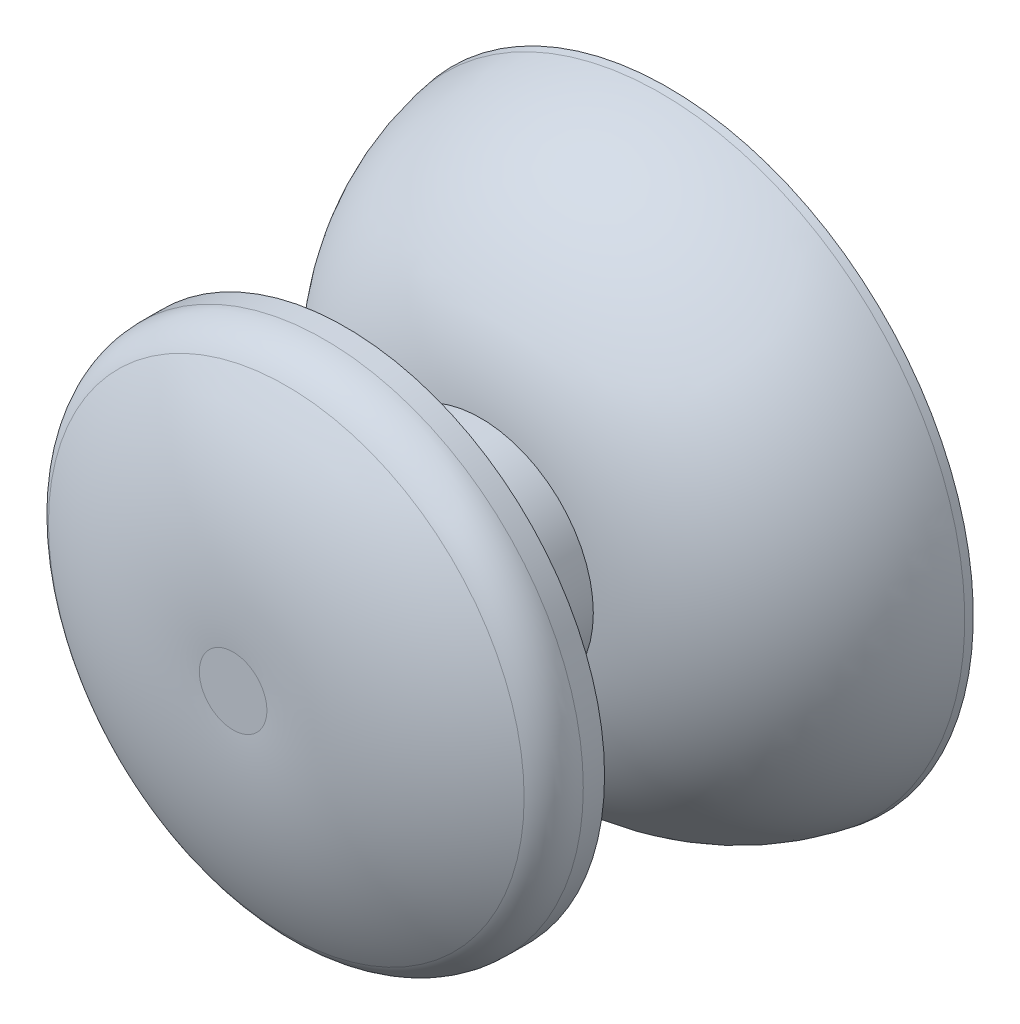
ISO-10303-21;
HEADER;
FILE_DESCRIPTION(('STEP AP214'),'2;1');
FILE_NAME('part.step','',(''),(''),'','','');
FILE_SCHEMA(('AUTOMOTIVE_DESIGN { 1 0 10303 214 1 1 1 1 }'));
ENDSEC;
DATA;
#1=APPLICATION_CONTEXT('core data for automotive mechanical design processes');
#2=APPLICATION_PROTOCOL_DEFINITION('international standard','automotive_design',2000,#1);
#3=PRODUCT_CONTEXT('',#1,'mechanical');
#4=PRODUCT('Part','Part','',(#3));
#5=PRODUCT_RELATED_PRODUCT_CATEGORY('part','',(#4));
#6=PRODUCT_DEFINITION_FORMATION('','',#4);
#7=PRODUCT_DEFINITION_CONTEXT('part definition',#1,'design');
#8=PRODUCT_DEFINITION('design','',#6,#7);
#9=PRODUCT_DEFINITION_SHAPE('','',#8);
#10=(LENGTH_UNIT() NAMED_UNIT(*) SI_UNIT(.MILLI.,.METRE.));
#11=(NAMED_UNIT(*) PLANE_ANGLE_UNIT() SI_UNIT($,.RADIAN.));
#12=(NAMED_UNIT(*) SI_UNIT($,.STERADIAN.) SOLID_ANGLE_UNIT());
#13=UNCERTAINTY_MEASURE_WITH_UNIT(LENGTH_MEASURE(1.E-05),#10,'distance_accuracy_value','');
#14=(GEOMETRIC_REPRESENTATION_CONTEXT(3) GLOBAL_UNCERTAINTY_ASSIGNED_CONTEXT((#13)) GLOBAL_UNIT_ASSIGNED_CONTEXT((#10,
#11,#12)) REPRESENTATION_CONTEXT('',''));
#15=CARTESIAN_POINT('',(0.,0.,0.));
#16=DIRECTION('',(0.,0.,1.));
#17=DIRECTION('',(1.,0.,0.));
#18=AXIS2_PLACEMENT_3D('',#15,#16,#17);
#19=CARTESIAN_POINT('',(55.2886051822846,12.3610868283743,18.2552883496559));
#20=DIRECTION('',(0.,0.,-1.));
#21=DIRECTION('',(-1.,0.,0.));
#22=AXIS2_PLACEMENT_3D('',#19,#20,#21);
#23=DEGENERATE_TOROIDAL_SURFACE('',#22,2.30270713318515,15.5154899332562,.T.);
#24=CARTESIAN_POINT('',(55.2886051822846,12.3610868283743,33.75));
#25=DIRECTION('',(0.,0.,-1.));
#26=DIRECTION('',(-1.,0.,0.));
#27=AXIS2_PLACEMENT_3D('',#24,#25,#26);
#28=CIRCLE('',#27,1.49999999999958);
#29=CARTESIAN_POINT('',(53.788605182285,12.3610868283743,33.75));
#30=VERTEX_POINT('',#29);
#31=EDGE_CURVE('E10',#30,#30,#28,.T.);
#32=ORIENTED_EDGE('',*,*,#31,.T.);
#33=EDGE_LOOP('',(#32));
#34=FACE_BOUND('',#33,.T.);
#35=CARTESIAN_POINT('',(55.2886051822846,12.3610868283743,31.3878518606448));
#36=DIRECTION('',(0.,0.,-1.));
#37=DIRECTION('',(-1.,0.,0.));
#38=AXIS2_PLACEMENT_3D('',#35,#36,#37);
#39=CIRCLE('',#38,10.5650435762754);
#40=CARTESIAN_POINT('',(44.7235616060092,12.3610868283743,31.3878518606448));
#41=VERTEX_POINT('',#40);
#42=EDGE_CURVE('E75',#41,#41,#39,.T.);
#43=ORIENTED_EDGE('',*,*,#42,.F.);
#44=EDGE_LOOP('',(#43));
#45=FACE_BOUND('',#44,.T.);
#46=ADVANCED_FACE('F32',(#34,#45),#23,.T.);
#47=CARTESIAN_POINT('',(56.7886051822842,12.3610868283743,33.75));
#48=DIRECTION('',(0.,0.,1.));
#49=DIRECTION('',(1.,0.,0.));
#50=AXIS2_PLACEMENT_3D('',#47,#48,#49);
#51=PLANE('',#50);
#52=ORIENTED_EDGE('',*,*,#31,.F.);
#53=EDGE_LOOP('',(#52));
#54=FACE_BOUND('',#53,.T.);
#55=ADVANCED_FACE('F83',(#54),#51,.T.);
#56=CARTESIAN_POINT('',(55.2886051822846,12.3610868283743,24.5842158486551));
#57=DIRECTION('',(0.,0.,-1.));
#58=DIRECTION('',(-1.,0.,0.));
#59=AXIS2_PLACEMENT_3D('',#56,#57,#58);
#60=PLANE('',#59);
#61=CARTESIAN_POINT('',(55.2886051822846,12.3610868283743,24.5842158486551));
#62=DIRECTION('',(0.,0.,-1.));
#63=DIRECTION('',(-1.,0.,0.));
#64=AXIS2_PLACEMENT_3D('',#61,#62,#63);
#65=CIRCLE('',#64,1.61377989283939);
#66=CARTESIAN_POINT('',(53.6748252894452,12.3610868283743,24.5842158486551));
#67=VERTEX_POINT('',#66);
#68=EDGE_CURVE('E38',#67,#67,#65,.T.);
#69=ORIENTED_EDGE('',*,*,#68,.T.);
#70=EDGE_LOOP('',(#69));
#71=FACE_BOUND('',#70,.T.);
#72=ADVANCED_FACE('F87',(#71),#60,.T.);
#73=CARTESIAN_POINT('',(55.2886051822846,12.3610868283743,33.7707782829122));
#74=DIRECTION('',(0.,0.,-1.));
#75=DIRECTION('',(-1.,0.,0.));
#76=AXIS2_PLACEMENT_3D('',#73,#74,#75);
#77=CYLINDRICAL_SURFACE('',#76,1.61377989283939);
#78=CARTESIAN_POINT('',(55.2886051822846,12.3610868283743,19.6671079243275));
#79=DIRECTION('',(0.,0.,-1.));
#80=DIRECTION('',(-1.,0.,0.));
#81=AXIS2_PLACEMENT_3D('',#78,#79,#80);
#82=CIRCLE('',#81,1.61377989283939);
#83=CARTESIAN_POINT('',(53.6748252894452,12.3610868283743,19.6671079243275));
#84=VERTEX_POINT('',#83);
#85=EDGE_CURVE('E42',#84,#84,#82,.T.);
#86=ORIENTED_EDGE('',*,*,#85,.T.);
#87=EDGE_LOOP('',(#86));
#88=FACE_BOUND('',#87,.T.);
#89=ORIENTED_EDGE('',*,*,#68,.F.);
#90=EDGE_LOOP('',(#89));
#91=FACE_BOUND('',#90,.T.);
#92=ADVANCED_FACE('F92',(#88,#91),#77,.F.);
#93=CARTESIAN_POINT('',(56.902385075124,12.3610868283743,19.6671079243275));
#94=DIRECTION('',(0.,0.,-1.));
#95=DIRECTION('',(-1.,0.,0.));
#96=AXIS2_PLACEMENT_3D('',#93,#94,#95);
#97=PLANE('',#96);
#98=CARTESIAN_POINT('',(55.2886051822846,12.3610868283743,19.6671079243275));
#99=DIRECTION('',(0.,0.,-1.));
#100=DIRECTION('',(-1.,0.,0.));
#101=AXIS2_PLACEMENT_3D('',#98,#99,#100);
#102=CIRCLE('',#101,8.82212376583157);
#103=CARTESIAN_POINT('',(46.466481416453,12.3610868283743,19.6671079243275));
#104=VERTEX_POINT('',#103);
#105=EDGE_CURVE('E46',#104,#104,#102,.T.);
#106=ORIENTED_EDGE('',*,*,#105,.T.);
#107=EDGE_LOOP('',(#106));
#108=FACE_BOUND('',#107,.T.);
#109=ORIENTED_EDGE('',*,*,#85,.F.);
#110=EDGE_LOOP('',(#109));
#111=FACE_BOUND('',#110,.T.);
#112=ADVANCED_FACE('F97',(#108,#111),#97,.T.);
#113=CARTESIAN_POINT('',(55.2886051822846,12.3610868283743,13.0193991709851));
#114=DIRECTION('',(0.,0.,-1.));
#115=DIRECTION('',(-1.,0.,0.));
#116=AXIS2_PLACEMENT_3D('',#113,#114,#115);
#117=DEGENERATE_TOROIDAL_SURFACE('',#116,3.85649333739738,8.29756091999675,.T.);
#118=CARTESIAN_POINT('',(55.2886051822846,12.3610868283743,14.75));
#119=DIRECTION('',(0.,0.,-1.));
#120=DIRECTION('',(-1.,0.,0.));
#121=AXIS2_PLACEMENT_3D('',#118,#119,#120);
#122=CIRCLE('',#121,11.9715742360496);
#123=CARTESIAN_POINT('',(43.317030946235,12.3610868283743,14.75));
#124=VERTEX_POINT('',#123);
#125=EDGE_CURVE('E51',#124,#124,#122,.T.);
#126=ORIENTED_EDGE('',*,*,#125,.T.);
#127=EDGE_LOOP('',(#126));
#128=FACE_BOUND('',#127,.T.);
#129=ORIENTED_EDGE('',*,*,#105,.F.);
#130=EDGE_LOOP('',(#129));
#131=FACE_BOUND('',#130,.T.);
#132=ADVANCED_FACE('F101',(#128,#131),#117,.F.);
#133=CARTESIAN_POINT('',(55.2886051822846,12.3610868283743,14.75));
#134=DIRECTION('',(0.,0.,-1.));
#135=DIRECTION('',(-1.,0.,0.));
#136=AXIS2_PLACEMENT_3D('',#133,#134,#135);
#137=CONICAL_SURFACE('',#136,11.9715742360496,0.210109931154276);
#138=CARTESIAN_POINT('',(55.2886051822846,12.3610868283743,14.42433044389));
#139=DIRECTION('',(0.,0.,-1.));
#140=DIRECTION('',(-1.,0.,0.));
#141=AXIS2_PLACEMENT_3D('',#138,#139,#140);
#142=CIRCLE('',#141,12.0410256698465);
#143=CARTESIAN_POINT('',(43.2475795124381,12.3610868283743,14.42433044389));
#144=VERTEX_POINT('',#143);
#145=EDGE_CURVE('E54',#144,#144,#142,.T.);
#146=ORIENTED_EDGE('',*,*,#145,.T.);
#147=EDGE_LOOP('',(#146));
#148=FACE_BOUND('',#147,.T.);
#149=ORIENTED_EDGE('',*,*,#125,.F.);
#150=EDGE_LOOP('',(#149));
#151=FACE_BOUND('',#150,.T.);
#152=ADVANCED_FACE('F105',(#148,#151),#137,.F.);
#153=CARTESIAN_POINT('',(67.3296308521311,12.3610868283743,14.42433044389));
#154=DIRECTION('',(0.,0.,-1.));
#155=DIRECTION('',(-1.,0.,0.));
#156=AXIS2_PLACEMENT_3D('',#153,#154,#155);
#157=PLANE('',#156);
#158=CARTESIAN_POINT('',(55.2886051822846,12.3610868283743,14.42433044389));
#159=DIRECTION('',(0.,0.,-1.));
#160=DIRECTION('',(-1.,0.,0.));
#161=AXIS2_PLACEMENT_3D('',#158,#159,#160);
#162=CIRCLE('',#161,13.5537477082164);
#163=CARTESIAN_POINT('',(41.7348574740682,12.3610868283743,14.42433044389));
#164=VERTEX_POINT('',#163);
#165=EDGE_CURVE('E57',#164,#164,#162,.T.);
#166=ORIENTED_EDGE('',*,*,#165,.T.);
#167=EDGE_LOOP('',(#166));
#168=FACE_BOUND('',#167,.T.);
#169=ORIENTED_EDGE('',*,*,#145,.F.);
#170=EDGE_LOOP('',(#169));
#171=FACE_BOUND('',#170,.T.);
#172=ADVANCED_FACE('F109',(#168,#171),#157,.T.);
#173=CARTESIAN_POINT('',(55.2886051822846,12.3610868283743,14.42433044389));
#174=DIRECTION('',(0.,0.,-1.));
#175=DIRECTION('',(-1.,0.,0.));
#176=AXIS2_PLACEMENT_3D('',#173,#174,#175);
#177=CONICAL_SURFACE('',#176,13.5537477082164,0.163563181067571);
#178=CARTESIAN_POINT('',(55.2886051822846,12.3610868283743,14.75));
#179=DIRECTION('',(0.,0.,-1.));
#180=DIRECTION('',(-1.,0.,0.));
#181=AXIS2_PLACEMENT_3D('',#178,#179,#180);
#182=CIRCLE('',#181,13.5);
#183=CARTESIAN_POINT('',(41.7886051822846,12.3610868283743,14.75));
#184=VERTEX_POINT('',#183);
#185=EDGE_CURVE('E60',#184,#184,#182,.T.);
#186=ORIENTED_EDGE('',*,*,#185,.T.);
#187=EDGE_LOOP('',(#186));
#188=FACE_BOUND('',#187,.T.);
#189=ORIENTED_EDGE('',*,*,#165,.F.);
#190=EDGE_LOOP('',(#189));
#191=FACE_BOUND('',#190,.T.);
#192=ADVANCED_FACE('F113',(#188,#191),#177,.T.);
#193=CARTESIAN_POINT('',(55.2886051822846,12.3610868283743,13.0193991709851));
#194=DIRECTION('',(0.,0.,-1.));
#195=DIRECTION('',(-1.,0.,0.));
#196=AXIS2_PLACEMENT_3D('',#193,#194,#195);
#197=DEGENERATE_TOROIDAL_SURFACE('',#196,3.85649333739738,9.79756091999665,.T.);
#198=CARTESIAN_POINT('',(55.2886051822846,12.3610868283743,22.7500000000002));
#199=DIRECTION('',(0.,0.,-1.));
#200=DIRECTION('',(-1.,0.,0.));
#201=AXIS2_PLACEMENT_3D('',#198,#199,#200);
#202=CIRCLE('',#201,5.00000000000002);
#203=CARTESIAN_POINT('',(50.2886051822846,12.3610868283743,22.7500000000002));
#204=VERTEX_POINT('',#203);
#205=EDGE_CURVE('E63',#204,#204,#202,.T.);
#206=ORIENTED_EDGE('',*,*,#205,.T.);
#207=EDGE_LOOP('',(#206));
#208=FACE_BOUND('',#207,.T.);
#209=ORIENTED_EDGE('',*,*,#185,.F.);
#210=EDGE_LOOP('',(#209));
#211=FACE_BOUND('',#210,.T.);
#212=ADVANCED_FACE('F117',(#208,#211),#197,.T.);
#213=CARTESIAN_POINT('',(55.2886051822846,12.3610868283743,33.7707782829122));
#214=DIRECTION('',(0.,0.,-1.));
#215=DIRECTION('',(-1.,0.,0.));
#216=AXIS2_PLACEMENT_3D('',#213,#214,#215);
#217=CYLINDRICAL_SURFACE('',#216,5.00000000000001);
#218=CARTESIAN_POINT('',(55.2886051822846,12.3610868283743,28.75));
#219=DIRECTION('',(0.,0.,-1.));
#220=DIRECTION('',(-1.,0.,0.));
#221=AXIS2_PLACEMENT_3D('',#218,#219,#220);
#222=CIRCLE('',#221,5.);
#223=CARTESIAN_POINT('',(50.2886051822846,12.3610868283743,28.75));
#224=VERTEX_POINT('',#223);
#225=EDGE_CURVE('E66',#224,#224,#222,.T.);
#226=ORIENTED_EDGE('',*,*,#225,.T.);
#227=EDGE_LOOP('',(#226));
#228=FACE_BOUND('',#227,.T.);
#229=ORIENTED_EDGE('',*,*,#205,.F.);
#230=EDGE_LOOP('',(#229));
#231=FACE_BOUND('',#230,.T.);
#232=ADVANCED_FACE('F121',(#228,#231),#217,.T.);
#233=CARTESIAN_POINT('',(60.2886051822846,12.3610868283743,28.75));
#234=DIRECTION('',(0.,0.,-1.));
#235=DIRECTION('',(-1.,0.,0.));
#236=AXIS2_PLACEMENT_3D('',#233,#234,#235);
#237=PLANE('',#236);
#238=CARTESIAN_POINT('',(55.2886051822846,12.3610868283743,28.75));
#239=DIRECTION('',(0.,0.,-1.));
#240=DIRECTION('',(-1.,0.,0.));
#241=AXIS2_PLACEMENT_3D('',#238,#239,#240);
#242=CIRCLE('',#241,11.5);
#243=CARTESIAN_POINT('',(43.7886051822846,12.3610868283743,28.75));
#244=VERTEX_POINT('',#243);
#245=EDGE_CURVE('E69',#244,#244,#242,.T.);
#246=ORIENTED_EDGE('',*,*,#245,.T.);
#247=EDGE_LOOP('',(#246));
#248=FACE_BOUND('',#247,.T.);
#249=ORIENTED_EDGE('',*,*,#225,.F.);
#250=EDGE_LOOP('',(#249));
#251=FACE_BOUND('',#250,.T.);
#252=ADVANCED_FACE('F125',(#248,#251),#237,.T.);
#253=CARTESIAN_POINT('',(55.2886051822846,12.3610868283743,33.7707782829122));
#254=DIRECTION('',(0.,0.,-1.));
#255=DIRECTION('',(-1.,0.,0.));
#256=AXIS2_PLACEMENT_3D('',#253,#254,#255);
#257=CYLINDRICAL_SURFACE('',#256,11.5);
#258=CARTESIAN_POINT('',(55.2886051822846,12.3610868283743,29.6950192697976));
#259=DIRECTION('',(0.,0.,-1.));
#260=DIRECTION('',(-1.,0.,0.));
#261=AXIS2_PLACEMENT_3D('',#258,#259,#260);
#262=CIRCLE('',#261,11.5);
#263=CARTESIAN_POINT('',(43.7886051822846,12.3610868283743,29.6950192697976));
#264=VERTEX_POINT('',#263);
#265=EDGE_CURVE('E72',#264,#264,#262,.T.);
#266=ORIENTED_EDGE('',*,*,#265,.T.);
#267=EDGE_LOOP('',(#266));
#268=FACE_BOUND('',#267,.T.);
#269=ORIENTED_EDGE('',*,*,#245,.F.);
#270=EDGE_LOOP('',(#269));
#271=FACE_BOUND('',#270,.T.);
#272=ADVANCED_FACE('F129',(#268,#271),#257,.T.);
#273=CARTESIAN_POINT('',(55.2886051822846,12.3610868283743,29.6950192697976));
#274=DIRECTION('',(0.,0.,-1.));
#275=DIRECTION('',(-1.,0.,0.));
#276=AXIS2_PLACEMENT_3D('',#273,#274,#275);
#277=TOROIDAL_SURFACE('',#276,9.5,2.00000000000001);
#278=ORIENTED_EDGE('',*,*,#42,.T.);
#279=EDGE_LOOP('',(#278));
#280=FACE_BOUND('',#279,.T.);
#281=ORIENTED_EDGE('',*,*,#265,.F.);
#282=EDGE_LOOP('',(#281));
#283=FACE_BOUND('',#282,.T.);
#284=ADVANCED_FACE('F79',(#280,#283),#277,.T.);
#285=CLOSED_SHELL('',(#46,#55,#72,#92,#112,#132,#152,#172,#192,#212,#232,#252,#272,#284));
#286=MANIFOLD_SOLID_BREP('B2',#285);
#287=ADVANCED_BREP_SHAPE_REPRESENTATION('',(#18,#286),#14);
#288=SHAPE_DEFINITION_REPRESENTATION(#9,#287);
ENDSEC;
END-ISO-10303-21;
